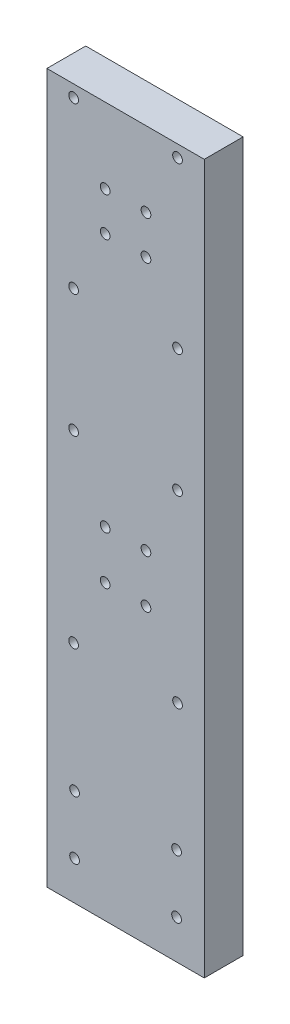
ISO-10303-21;
HEADER;
FILE_DESCRIPTION(('STEP AP214'),'2;1');
FILE_NAME('part.step','',(''),(''),'','','');
FILE_SCHEMA(('AUTOMOTIVE_DESIGN { 1 0 10303 214 1 1 1 1 }'));
ENDSEC;
DATA;
#1=APPLICATION_CONTEXT('core data for automotive mechanical design processes');
#2=APPLICATION_PROTOCOL_DEFINITION('international standard','automotive_design',2000,#1);
#3=PRODUCT_CONTEXT('',#1,'mechanical');
#4=PRODUCT('Part','Part','',(#3));
#5=PRODUCT_RELATED_PRODUCT_CATEGORY('part','',(#4));
#6=PRODUCT_DEFINITION_FORMATION('','',#4);
#7=PRODUCT_DEFINITION_CONTEXT('part definition',#1,'design');
#8=PRODUCT_DEFINITION('design','',#6,#7);
#9=PRODUCT_DEFINITION_SHAPE('','',#8);
#10=(LENGTH_UNIT() NAMED_UNIT(*) SI_UNIT(.MILLI.,.METRE.));
#11=(NAMED_UNIT(*) PLANE_ANGLE_UNIT() SI_UNIT($,.RADIAN.));
#12=(NAMED_UNIT(*) SI_UNIT($,.STERADIAN.) SOLID_ANGLE_UNIT());
#13=UNCERTAINTY_MEASURE_WITH_UNIT(LENGTH_MEASURE(1.E-05),#10,'distance_accuracy_value','');
#14=(GEOMETRIC_REPRESENTATION_CONTEXT(3) GLOBAL_UNCERTAINTY_ASSIGNED_CONTEXT((#13)) GLOBAL_UNIT_ASSIGNED_CONTEXT((#10,
#11,#12)) REPRESENTATION_CONTEXT('',''));
#15=CARTESIAN_POINT('',(0.,0.,0.));
#16=DIRECTION('',(0.,0.,1.));
#17=DIRECTION('',(1.,0.,0.));
#18=AXIS2_PLACEMENT_3D('',#15,#16,#17);
#19=CARTESIAN_POINT('',(0.,0.,4.));
#20=DIRECTION('',(0.,0.,-1.));
#21=DIRECTION('',(-1.,0.,0.));
#22=AXIS2_PLACEMENT_3D('',#19,#20,#21);
#23=PLANE('',#22);
#24=CARTESIAN_POINT('',(10.1999999999987,65.26,4.));
#25=DIRECTION('',(0.,0.,1.));
#26=DIRECTION('',(-1.,0.,0.));
#27=AXIS2_PLACEMENT_3D('',#24,#25,#26);
#28=CIRCLE('',#27,0.499999999999999);
#29=CARTESIAN_POINT('',(9.6999999999987,65.26,4.));
#30=VERTEX_POINT('',#29);
#31=EDGE_CURVE('E217',#30,#30,#28,.T.);
#32=ORIENTED_EDGE('',*,*,#31,.F.);
#33=EDGE_LOOP('',(#32));
#34=FACE_BOUND('',#33,.T.);
#35=CARTESIAN_POINT('',(2.7500000000006,54.76,4.));
#36=DIRECTION('',(0.,0.,1.));
#37=DIRECTION('',(1.,0.,0.));
#38=AXIS2_PLACEMENT_3D('',#35,#36,#37);
#39=CIRCLE('',#38,0.500000000000005);
#40=CARTESIAN_POINT('',(3.2500000000006,54.76,4.));
#41=VERTEX_POINT('',#40);
#42=EDGE_CURVE('E205',#41,#41,#39,.T.);
#43=ORIENTED_EDGE('',*,*,#42,.F.);
#44=EDGE_LOOP('',(#43));
#45=FACE_BOUND('',#44,.T.);
#46=CARTESIAN_POINT('',(13.350000000001,10.,4.));
#47=DIRECTION('',(0.,0.,1.));
#48=DIRECTION('',(-1.,0.,0.));
#49=AXIS2_PLACEMENT_3D('',#46,#47,#48);
#50=CIRCLE('',#49,0.499999999999999);
#51=CARTESIAN_POINT('',(12.850000000001,10.,4.));
#52=VERTEX_POINT('',#51);
#53=EDGE_CURVE('E193',#52,#52,#50,.T.);
#54=ORIENTED_EDGE('',*,*,#53,.F.);
#55=EDGE_LOOP('',(#54));
#56=FACE_BOUND('',#55,.T.);
#57=CARTESIAN_POINT('',(13.4500000000019,54.76,4.));
#58=DIRECTION('',(0.,0.,1.));
#59=DIRECTION('',(1.,0.,0.));
#60=AXIS2_PLACEMENT_3D('',#57,#58,#59);
#61=CIRCLE('',#60,0.499999999999999);
#62=CARTESIAN_POINT('',(13.9500000000019,54.76,4.));
#63=VERTEX_POINT('',#62);
#64=EDGE_CURVE('E181',#63,#63,#61,.T.);
#65=ORIENTED_EDGE('',*,*,#64,.F.);
#66=EDGE_LOOP('',(#65));
#67=FACE_BOUND('',#66,.T.);
#68=CARTESIAN_POINT('',(2.84999999999999,10.,4.));
#69=DIRECTION('',(0.,0.,1.));
#70=DIRECTION('',(1.,0.,0.));
#71=AXIS2_PLACEMENT_3D('',#68,#69,#70);
#72=CIRCLE('',#71,0.499999999999999);
#73=CARTESIAN_POINT('',(3.34999999999999,10.,4.));
#74=VERTEX_POINT('',#73);
#75=EDGE_CURVE('E169',#74,#74,#72,.T.);
#76=ORIENTED_EDGE('',*,*,#75,.F.);
#77=EDGE_LOOP('',(#76));
#78=FACE_BOUND('',#77,.T.);
#79=CARTESIAN_POINT('',(6.00000000000001,35.11,4.));
#80=DIRECTION('',(0.,0.,1.));
#81=DIRECTION('',(1.,0.,0.));
#82=AXIS2_PLACEMENT_3D('',#79,#80,#81);
#83=CIRCLE('',#82,0.500000000000002);
#84=CARTESIAN_POINT('',(6.50000000000001,35.11,4.));
#85=VERTEX_POINT('',#84);
#86=EDGE_CURVE('E157',#85,#85,#83,.T.);
#87=ORIENTED_EDGE('',*,*,#86,.F.);
#88=EDGE_LOOP('',(#87));
#89=FACE_BOUND('',#88,.T.);
#90=CARTESIAN_POINT('',(10.2000000000001,35.11,4.));
#91=DIRECTION('',(0.,0.,1.));
#92=DIRECTION('',(1.,0.,0.));
#93=AXIS2_PLACEMENT_3D('',#90,#91,#92);
#94=CIRCLE('',#93,0.499999999999999);
#95=CARTESIAN_POINT('',(10.7000000000001,35.11,4.));
#96=VERTEX_POINT('',#95);
#97=EDGE_CURVE('E145',#96,#96,#94,.T.);
#98=ORIENTED_EDGE('',*,*,#97,.F.);
#99=EDGE_LOOP('',(#98));
#100=FACE_BOUND('',#99,.T.);
#101=CARTESIAN_POINT('',(6.00000000000001,30.15,4.));
#102=DIRECTION('',(0.,0.,1.));
#103=DIRECTION('',(1.,0.,0.));
#104=AXIS2_PLACEMENT_3D('',#101,#102,#103);
#105=CIRCLE('',#104,0.5);
#106=CARTESIAN_POINT('',(6.50000000000001,30.15,4.));
#107=VERTEX_POINT('',#106);
#108=EDGE_CURVE('E133',#107,#107,#105,.T.);
#109=ORIENTED_EDGE('',*,*,#108,.F.);
#110=EDGE_LOOP('',(#109));
#111=FACE_BOUND('',#110,.T.);
#112=CARTESIAN_POINT('',(5.99999999999857,61.26,4.));
#113=DIRECTION('',(0.,0.,1.));
#114=DIRECTION('',(1.,0.,0.));
#115=AXIS2_PLACEMENT_3D('',#112,#113,#114);
#116=CIRCLE('',#115,0.500000000000003);
#117=CARTESIAN_POINT('',(6.49999999999857,61.26,4.));
#118=VERTEX_POINT('',#117);
#119=EDGE_CURVE('E121',#118,#118,#116,.T.);
#120=ORIENTED_EDGE('',*,*,#119,.F.);
#121=EDGE_LOOP('',(#120));
#122=FACE_BOUND('',#121,.T.);
#123=CARTESIAN_POINT('',(2.75000000000059,71.76,4.));
#124=DIRECTION('',(0.,0.,1.));
#125=DIRECTION('',(-1.,0.,0.));
#126=AXIS2_PLACEMENT_3D('',#123,#124,#125);
#127=CIRCLE('',#126,0.500000000000005);
#128=CARTESIAN_POINT('',(2.25000000000058,71.76,4.));
#129=VERTEX_POINT('',#128);
#130=EDGE_CURVE('E100',#129,#129,#127,.T.);
#131=ORIENTED_EDGE('',*,*,#130,.F.);
#132=EDGE_LOOP('',(#131));
#133=FACE_BOUND('',#132,.T.);
#134=DIRECTION('',(1.,0.,0.));
#135=VECTOR('',#134,1.);
#136=CARTESIAN_POINT('',(0.,0.,4.));
#137=LINE('',#136,#135);
#138=CARTESIAN_POINT('',(0.,0.,4.));
#139=VERTEX_POINT('',#138);
#140=CARTESIAN_POINT('',(16.2,0.,4.));
#141=VERTEX_POINT('',#140);
#142=EDGE_CURVE('E85',#139,#141,#137,.T.);
#143=ORIENTED_EDGE('',*,*,#142,.T.);
#144=DIRECTION('',(0.,1.,0.));
#145=VECTOR('',#144,1.);
#146=CARTESIAN_POINT('',(16.2,72.99,4.));
#147=LINE('',#146,#145);
#148=CARTESIAN_POINT('',(16.2,72.99,4.));
#149=VERTEX_POINT('',#148);
#150=EDGE_CURVE('E80',#141,#149,#147,.T.);
#151=ORIENTED_EDGE('',*,*,#150,.T.);
#152=DIRECTION('',(-1.,0.,0.));
#153=VECTOR('',#152,1.);
#154=CARTESIAN_POINT('',(0.,72.99,4.));
#155=LINE('',#154,#153);
#156=CARTESIAN_POINT('',(0.,72.99,4.));
#157=VERTEX_POINT('',#156);
#158=EDGE_CURVE('E83',#149,#157,#155,.T.);
#159=ORIENTED_EDGE('',*,*,#158,.T.);
#160=DIRECTION('',(0.,-1.,0.));
#161=VECTOR('',#160,1.);
#162=CARTESIAN_POINT('',(0.,0.,4.));
#163=LINE('',#162,#161);
#164=EDGE_CURVE('E50',#157,#139,#163,.T.);
#165=ORIENTED_EDGE('',*,*,#164,.T.);
#166=EDGE_LOOP('',(#143,#151,#159,#165));
#167=FACE_BOUND('',#166,.T.);
#168=CARTESIAN_POINT('',(10.1999999999987,61.26,4.));
#169=DIRECTION('',(0.,0.,1.));
#170=DIRECTION('',(1.,0.,0.));
#171=AXIS2_PLACEMENT_3D('',#168,#169,#170);
#172=CIRCLE('',#171,0.499999999999999);
#173=CARTESIAN_POINT('',(10.6999999999987,61.26,4.));
#174=VERTEX_POINT('',#173);
#175=EDGE_CURVE('E115',#174,#174,#172,.T.);
#176=ORIENTED_EDGE('',*,*,#175,.F.);
#177=EDGE_LOOP('',(#176));
#178=FACE_BOUND('',#177,.T.);
#179=CARTESIAN_POINT('',(10.2000000000001,30.15,4.));
#180=DIRECTION('',(0.,0.,1.));
#181=DIRECTION('',(1.,0.,0.));
#182=AXIS2_PLACEMENT_3D('',#179,#180,#181);
#183=CIRCLE('',#182,0.499999999999999);
#184=CARTESIAN_POINT('',(10.7000000000001,30.15,4.));
#185=VERTEX_POINT('',#184);
#186=EDGE_CURVE('E127',#185,#185,#183,.T.);
#187=ORIENTED_EDGE('',*,*,#186,.F.);
#188=EDGE_LOOP('',(#187));
#189=FACE_BOUND('',#188,.T.);
#190=CARTESIAN_POINT('',(13.4500000000001,23.15,4.));
#191=DIRECTION('',(0.,0.,1.));
#192=DIRECTION('',(1.,0.,0.));
#193=AXIS2_PLACEMENT_3D('',#190,#191,#192);
#194=CIRCLE('',#193,0.499999999999999);
#195=CARTESIAN_POINT('',(13.9500000000001,23.15,4.));
#196=VERTEX_POINT('',#195);
#197=EDGE_CURVE('E139',#196,#196,#194,.T.);
#198=ORIENTED_EDGE('',*,*,#197,.F.);
#199=EDGE_LOOP('',(#198));
#200=FACE_BOUND('',#199,.T.);
#201=CARTESIAN_POINT('',(2.75000000000003,23.15,4.));
#202=DIRECTION('',(0.,0.,1.));
#203=DIRECTION('',(1.,0.,0.));
#204=AXIS2_PLACEMENT_3D('',#201,#202,#203);
#205=CIRCLE('',#204,0.499999999999999);
#206=CARTESIAN_POINT('',(3.25000000000003,23.15,4.));
#207=VERTEX_POINT('',#206);
#208=EDGE_CURVE('E151',#207,#207,#205,.T.);
#209=ORIENTED_EDGE('',*,*,#208,.F.);
#210=EDGE_LOOP('',(#209));
#211=FACE_BOUND('',#210,.T.);
#212=CARTESIAN_POINT('',(13.45,42.11,4.));
#213=DIRECTION('',(0.,0.,1.));
#214=DIRECTION('',(1.,0.,0.));
#215=AXIS2_PLACEMENT_3D('',#212,#213,#214);
#216=CIRCLE('',#215,0.499999999999999);
#217=CARTESIAN_POINT('',(13.95,42.11,4.));
#218=VERTEX_POINT('',#217);
#219=EDGE_CURVE('E163',#218,#218,#216,.T.);
#220=ORIENTED_EDGE('',*,*,#219,.F.);
#221=EDGE_LOOP('',(#220));
#222=FACE_BOUND('',#221,.T.);
#223=CARTESIAN_POINT('',(2.75000000000003,42.11,4.));
#224=DIRECTION('',(0.,0.,1.));
#225=DIRECTION('',(1.,0.,0.));
#226=AXIS2_PLACEMENT_3D('',#223,#224,#225);
#227=CIRCLE('',#226,0.499999999999999);
#228=CARTESIAN_POINT('',(3.25000000000003,42.11,4.));
#229=VERTEX_POINT('',#228);
#230=EDGE_CURVE('E175',#229,#229,#227,.T.);
#231=ORIENTED_EDGE('',*,*,#230,.F.);
#232=EDGE_LOOP('',(#231));
#233=FACE_BOUND('',#232,.T.);
#234=CARTESIAN_POINT('',(2.84999999999999,4.,4.));
#235=DIRECTION('',(0.,0.,1.));
#236=DIRECTION('',(1.,0.,0.));
#237=AXIS2_PLACEMENT_3D('',#234,#235,#236);
#238=CIRCLE('',#237,0.499999999999999);
#239=CARTESIAN_POINT('',(3.34999999999999,4.,4.));
#240=VERTEX_POINT('',#239);
#241=EDGE_CURVE('E187',#240,#240,#238,.T.);
#242=ORIENTED_EDGE('',*,*,#241,.F.);
#243=EDGE_LOOP('',(#242));
#244=FACE_BOUND('',#243,.T.);
#245=CARTESIAN_POINT('',(13.350000000001,4.,4.));
#246=DIRECTION('',(0.,0.,1.));
#247=DIRECTION('',(-1.,0.,0.));
#248=AXIS2_PLACEMENT_3D('',#245,#246,#247);
#249=CIRCLE('',#248,0.499999999999999);
#250=CARTESIAN_POINT('',(12.850000000001,4.,4.));
#251=VERTEX_POINT('',#250);
#252=EDGE_CURVE('E199',#251,#251,#249,.T.);
#253=ORIENTED_EDGE('',*,*,#252,.F.);
#254=EDGE_LOOP('',(#253));
#255=FACE_BOUND('',#254,.T.);
#256=CARTESIAN_POINT('',(5.99999999999856,65.26,4.));
#257=DIRECTION('',(0.,0.,1.));
#258=DIRECTION('',(-1.,0.,0.));
#259=AXIS2_PLACEMENT_3D('',#256,#257,#258);
#260=CIRCLE('',#259,0.500000000000003);
#261=CARTESIAN_POINT('',(5.49999999999856,65.26,4.));
#262=VERTEX_POINT('',#261);
#263=EDGE_CURVE('E211',#262,#262,#260,.T.);
#264=ORIENTED_EDGE('',*,*,#263,.F.);
#265=EDGE_LOOP('',(#264));
#266=FACE_BOUND('',#265,.T.);
#267=CARTESIAN_POINT('',(13.4500000000019,71.76,4.));
#268=DIRECTION('',(0.,0.,1.));
#269=DIRECTION('',(-1.,0.,0.));
#270=AXIS2_PLACEMENT_3D('',#267,#268,#269);
#271=CIRCLE('',#270,0.500000000000006);
#272=CARTESIAN_POINT('',(12.9500000000019,71.76,4.));
#273=VERTEX_POINT('',#272);
#274=EDGE_CURVE('E223',#273,#273,#271,.T.);
#275=ORIENTED_EDGE('',*,*,#274,.F.);
#276=EDGE_LOOP('',(#275));
#277=FACE_BOUND('',#276,.T.);
#278=ADVANCED_FACE('F33',(#34,#45,#56,#67,#78,#89,#100,#111,#122,#133,#167,#178,#189,#200,#211,
#222,#233,#244,#255,#266,#277),#23,.F.);
#279=CARTESIAN_POINT('',(0.,0.,0.));
#280=DIRECTION('',(0.,0.,-1.));
#281=DIRECTION('',(-1.,0.,0.));
#282=AXIS2_PLACEMENT_3D('',#279,#280,#281);
#283=PLANE('',#282);
#284=CARTESIAN_POINT('',(10.1999999999987,65.26,0.));
#285=DIRECTION('',(0.,0.,1.));
#286=DIRECTION('',(-1.,0.,0.));
#287=AXIS2_PLACEMENT_3D('',#284,#285,#286);
#288=CIRCLE('',#287,0.499999999999999);
#289=CARTESIAN_POINT('',(9.6999999999987,65.26,0.));
#290=VERTEX_POINT('',#289);
#291=EDGE_CURVE('E220',#290,#290,#288,.T.);
#292=ORIENTED_EDGE('',*,*,#291,.T.);
#293=EDGE_LOOP('',(#292));
#294=FACE_BOUND('',#293,.T.);
#295=CARTESIAN_POINT('',(2.7500000000006,54.76,0.));
#296=DIRECTION('',(0.,0.,1.));
#297=DIRECTION('',(1.,0.,0.));
#298=AXIS2_PLACEMENT_3D('',#295,#296,#297);
#299=CIRCLE('',#298,0.500000000000005);
#300=CARTESIAN_POINT('',(3.2500000000006,54.76,0.));
#301=VERTEX_POINT('',#300);
#302=EDGE_CURVE('E208',#301,#301,#299,.T.);
#303=ORIENTED_EDGE('',*,*,#302,.T.);
#304=EDGE_LOOP('',(#303));
#305=FACE_BOUND('',#304,.T.);
#306=CARTESIAN_POINT('',(13.350000000001,10.,0.));
#307=DIRECTION('',(0.,0.,1.));
#308=DIRECTION('',(-1.,0.,0.));
#309=AXIS2_PLACEMENT_3D('',#306,#307,#308);
#310=CIRCLE('',#309,0.499999999999999);
#311=CARTESIAN_POINT('',(12.850000000001,10.,0.));
#312=VERTEX_POINT('',#311);
#313=EDGE_CURVE('E196',#312,#312,#310,.T.);
#314=ORIENTED_EDGE('',*,*,#313,.T.);
#315=EDGE_LOOP('',(#314));
#316=FACE_BOUND('',#315,.T.);
#317=CARTESIAN_POINT('',(13.4500000000019,54.76,0.));
#318=DIRECTION('',(0.,0.,1.));
#319=DIRECTION('',(1.,0.,0.));
#320=AXIS2_PLACEMENT_3D('',#317,#318,#319);
#321=CIRCLE('',#320,0.499999999999999);
#322=CARTESIAN_POINT('',(13.9500000000019,54.76,0.));
#323=VERTEX_POINT('',#322);
#324=EDGE_CURVE('E184',#323,#323,#321,.T.);
#325=ORIENTED_EDGE('',*,*,#324,.T.);
#326=EDGE_LOOP('',(#325));
#327=FACE_BOUND('',#326,.T.);
#328=CARTESIAN_POINT('',(2.84999999999999,10.,0.));
#329=DIRECTION('',(0.,0.,1.));
#330=DIRECTION('',(1.,0.,0.));
#331=AXIS2_PLACEMENT_3D('',#328,#329,#330);
#332=CIRCLE('',#331,0.499999999999999);
#333=CARTESIAN_POINT('',(3.34999999999999,10.,0.));
#334=VERTEX_POINT('',#333);
#335=EDGE_CURVE('E172',#334,#334,#332,.T.);
#336=ORIENTED_EDGE('',*,*,#335,.T.);
#337=EDGE_LOOP('',(#336));
#338=FACE_BOUND('',#337,.T.);
#339=CARTESIAN_POINT('',(6.00000000000001,35.11,0.));
#340=DIRECTION('',(0.,0.,1.));
#341=DIRECTION('',(1.,0.,0.));
#342=AXIS2_PLACEMENT_3D('',#339,#340,#341);
#343=CIRCLE('',#342,0.500000000000002);
#344=CARTESIAN_POINT('',(6.50000000000001,35.11,0.));
#345=VERTEX_POINT('',#344);
#346=EDGE_CURVE('E160',#345,#345,#343,.T.);
#347=ORIENTED_EDGE('',*,*,#346,.T.);
#348=EDGE_LOOP('',(#347));
#349=FACE_BOUND('',#348,.T.);
#350=CARTESIAN_POINT('',(10.2000000000001,35.11,0.));
#351=DIRECTION('',(0.,0.,1.));
#352=DIRECTION('',(1.,0.,0.));
#353=AXIS2_PLACEMENT_3D('',#350,#351,#352);
#354=CIRCLE('',#353,0.499999999999999);
#355=CARTESIAN_POINT('',(10.7000000000001,35.11,0.));
#356=VERTEX_POINT('',#355);
#357=EDGE_CURVE('E148',#356,#356,#354,.T.);
#358=ORIENTED_EDGE('',*,*,#357,.T.);
#359=EDGE_LOOP('',(#358));
#360=FACE_BOUND('',#359,.T.);
#361=CARTESIAN_POINT('',(6.00000000000001,30.15,0.));
#362=DIRECTION('',(0.,0.,1.));
#363=DIRECTION('',(1.,0.,0.));
#364=AXIS2_PLACEMENT_3D('',#361,#362,#363);
#365=CIRCLE('',#364,0.5);
#366=CARTESIAN_POINT('',(6.50000000000001,30.15,0.));
#367=VERTEX_POINT('',#366);
#368=EDGE_CURVE('E136',#367,#367,#365,.T.);
#369=ORIENTED_EDGE('',*,*,#368,.T.);
#370=EDGE_LOOP('',(#369));
#371=FACE_BOUND('',#370,.T.);
#372=CARTESIAN_POINT('',(5.99999999999857,61.26,0.));
#373=DIRECTION('',(0.,0.,1.));
#374=DIRECTION('',(1.,0.,0.));
#375=AXIS2_PLACEMENT_3D('',#372,#373,#374);
#376=CIRCLE('',#375,0.500000000000003);
#377=CARTESIAN_POINT('',(6.49999999999857,61.26,0.));
#378=VERTEX_POINT('',#377);
#379=EDGE_CURVE('E124',#378,#378,#376,.T.);
#380=ORIENTED_EDGE('',*,*,#379,.T.);
#381=EDGE_LOOP('',(#380));
#382=FACE_BOUND('',#381,.T.);
#383=CARTESIAN_POINT('',(2.75000000000059,71.76,0.));
#384=DIRECTION('',(0.,0.,1.));
#385=DIRECTION('',(-1.,0.,0.));
#386=AXIS2_PLACEMENT_3D('',#383,#384,#385);
#387=CIRCLE('',#386,0.500000000000005);
#388=CARTESIAN_POINT('',(2.25000000000058,71.76,0.));
#389=VERTEX_POINT('',#388);
#390=EDGE_CURVE('E112',#389,#389,#387,.T.);
#391=ORIENTED_EDGE('',*,*,#390,.T.);
#392=EDGE_LOOP('',(#391));
#393=FACE_BOUND('',#392,.T.);
#394=DIRECTION('',(1.,0.,0.));
#395=VECTOR('',#394,1.);
#396=CARTESIAN_POINT('',(0.,0.,0.));
#397=LINE('',#396,#395);
#398=CARTESIAN_POINT('',(0.,0.,0.));
#399=VERTEX_POINT('',#398);
#400=CARTESIAN_POINT('',(16.2,0.,0.));
#401=VERTEX_POINT('',#400);
#402=EDGE_CURVE('E97',#399,#401,#397,.T.);
#403=ORIENTED_EDGE('',*,*,#402,.F.);
#404=DIRECTION('',(0.,-1.,0.));
#405=VECTOR('',#404,1.);
#406=CARTESIAN_POINT('',(0.,0.,0.));
#407=LINE('',#406,#405);
#408=CARTESIAN_POINT('',(0.,72.99,0.));
#409=VERTEX_POINT('',#408);
#410=EDGE_CURVE('E73',#409,#399,#407,.T.);
#411=ORIENTED_EDGE('',*,*,#410,.F.);
#412=DIRECTION('',(-1.,0.,0.));
#413=VECTOR('',#412,1.);
#414=CARTESIAN_POINT('',(0.,72.99,0.));
#415=LINE('',#414,#413);
#416=CARTESIAN_POINT('',(16.2,72.99,0.));
#417=VERTEX_POINT('',#416);
#418=EDGE_CURVE('E67',#417,#409,#415,.T.);
#419=ORIENTED_EDGE('',*,*,#418,.F.);
#420=DIRECTION('',(0.,1.,0.));
#421=VECTOR('',#420,1.);
#422=CARTESIAN_POINT('',(16.2,72.99,0.));
#423=LINE('',#422,#421);
#424=EDGE_CURVE('E89',#401,#417,#423,.T.);
#425=ORIENTED_EDGE('',*,*,#424,.F.);
#426=EDGE_LOOP('',(#403,#411,#419,#425));
#427=FACE_BOUND('',#426,.T.);
#428=CARTESIAN_POINT('',(10.1999999999987,61.26,0.));
#429=DIRECTION('',(0.,0.,1.));
#430=DIRECTION('',(1.,0.,0.));
#431=AXIS2_PLACEMENT_3D('',#428,#429,#430);
#432=CIRCLE('',#431,0.499999999999999);
#433=CARTESIAN_POINT('',(10.6999999999987,61.26,0.));
#434=VERTEX_POINT('',#433);
#435=EDGE_CURVE('E118',#434,#434,#432,.T.);
#436=ORIENTED_EDGE('',*,*,#435,.T.);
#437=EDGE_LOOP('',(#436));
#438=FACE_BOUND('',#437,.T.);
#439=CARTESIAN_POINT('',(10.2000000000001,30.15,0.));
#440=DIRECTION('',(0.,0.,1.));
#441=DIRECTION('',(1.,0.,0.));
#442=AXIS2_PLACEMENT_3D('',#439,#440,#441);
#443=CIRCLE('',#442,0.499999999999999);
#444=CARTESIAN_POINT('',(10.7000000000001,30.15,0.));
#445=VERTEX_POINT('',#444);
#446=EDGE_CURVE('E130',#445,#445,#443,.T.);
#447=ORIENTED_EDGE('',*,*,#446,.T.);
#448=EDGE_LOOP('',(#447));
#449=FACE_BOUND('',#448,.T.);
#450=CARTESIAN_POINT('',(13.4500000000001,23.15,0.));
#451=DIRECTION('',(0.,0.,1.));
#452=DIRECTION('',(1.,0.,0.));
#453=AXIS2_PLACEMENT_3D('',#450,#451,#452);
#454=CIRCLE('',#453,0.499999999999999);
#455=CARTESIAN_POINT('',(13.9500000000001,23.15,0.));
#456=VERTEX_POINT('',#455);
#457=EDGE_CURVE('E142',#456,#456,#454,.T.);
#458=ORIENTED_EDGE('',*,*,#457,.T.);
#459=EDGE_LOOP('',(#458));
#460=FACE_BOUND('',#459,.T.);
#461=CARTESIAN_POINT('',(2.75000000000003,23.15,0.));
#462=DIRECTION('',(0.,0.,1.));
#463=DIRECTION('',(1.,0.,0.));
#464=AXIS2_PLACEMENT_3D('',#461,#462,#463);
#465=CIRCLE('',#464,0.499999999999999);
#466=CARTESIAN_POINT('',(3.25000000000003,23.15,0.));
#467=VERTEX_POINT('',#466);
#468=EDGE_CURVE('E154',#467,#467,#465,.T.);
#469=ORIENTED_EDGE('',*,*,#468,.T.);
#470=EDGE_LOOP('',(#469));
#471=FACE_BOUND('',#470,.T.);
#472=CARTESIAN_POINT('',(13.45,42.11,0.));
#473=DIRECTION('',(0.,0.,1.));
#474=DIRECTION('',(1.,0.,0.));
#475=AXIS2_PLACEMENT_3D('',#472,#473,#474);
#476=CIRCLE('',#475,0.499999999999999);
#477=CARTESIAN_POINT('',(13.95,42.11,0.));
#478=VERTEX_POINT('',#477);
#479=EDGE_CURVE('E166',#478,#478,#476,.T.);
#480=ORIENTED_EDGE('',*,*,#479,.T.);
#481=EDGE_LOOP('',(#480));
#482=FACE_BOUND('',#481,.T.);
#483=CARTESIAN_POINT('',(2.75000000000003,42.11,0.));
#484=DIRECTION('',(0.,0.,1.));
#485=DIRECTION('',(1.,0.,0.));
#486=AXIS2_PLACEMENT_3D('',#483,#484,#485);
#487=CIRCLE('',#486,0.499999999999999);
#488=CARTESIAN_POINT('',(3.25000000000003,42.11,0.));
#489=VERTEX_POINT('',#488);
#490=EDGE_CURVE('E178',#489,#489,#487,.T.);
#491=ORIENTED_EDGE('',*,*,#490,.T.);
#492=EDGE_LOOP('',(#491));
#493=FACE_BOUND('',#492,.T.);
#494=CARTESIAN_POINT('',(2.84999999999999,4.,0.));
#495=DIRECTION('',(0.,0.,1.));
#496=DIRECTION('',(1.,0.,0.));
#497=AXIS2_PLACEMENT_3D('',#494,#495,#496);
#498=CIRCLE('',#497,0.499999999999999);
#499=CARTESIAN_POINT('',(3.34999999999999,4.,0.));
#500=VERTEX_POINT('',#499);
#501=EDGE_CURVE('E190',#500,#500,#498,.T.);
#502=ORIENTED_EDGE('',*,*,#501,.T.);
#503=EDGE_LOOP('',(#502));
#504=FACE_BOUND('',#503,.T.);
#505=CARTESIAN_POINT('',(13.350000000001,4.,0.));
#506=DIRECTION('',(0.,0.,1.));
#507=DIRECTION('',(-1.,0.,0.));
#508=AXIS2_PLACEMENT_3D('',#505,#506,#507);
#509=CIRCLE('',#508,0.499999999999999);
#510=CARTESIAN_POINT('',(12.850000000001,4.,0.));
#511=VERTEX_POINT('',#510);
#512=EDGE_CURVE('E202',#511,#511,#509,.T.);
#513=ORIENTED_EDGE('',*,*,#512,.T.);
#514=EDGE_LOOP('',(#513));
#515=FACE_BOUND('',#514,.T.);
#516=CARTESIAN_POINT('',(5.99999999999856,65.26,0.));
#517=DIRECTION('',(0.,0.,1.));
#518=DIRECTION('',(-1.,0.,0.));
#519=AXIS2_PLACEMENT_3D('',#516,#517,#518);
#520=CIRCLE('',#519,0.500000000000003);
#521=CARTESIAN_POINT('',(5.49999999999856,65.26,0.));
#522=VERTEX_POINT('',#521);
#523=EDGE_CURVE('E214',#522,#522,#520,.T.);
#524=ORIENTED_EDGE('',*,*,#523,.T.);
#525=EDGE_LOOP('',(#524));
#526=FACE_BOUND('',#525,.T.);
#527=CARTESIAN_POINT('',(13.4500000000019,71.76,0.));
#528=DIRECTION('',(0.,0.,1.));
#529=DIRECTION('',(-1.,0.,0.));
#530=AXIS2_PLACEMENT_3D('',#527,#528,#529);
#531=CIRCLE('',#530,0.500000000000006);
#532=CARTESIAN_POINT('',(12.9500000000019,71.76,0.));
#533=VERTEX_POINT('',#532);
#534=EDGE_CURVE('E226',#533,#533,#531,.T.);
#535=ORIENTED_EDGE('',*,*,#534,.T.);
#536=EDGE_LOOP('',(#535));
#537=FACE_BOUND('',#536,.T.);
#538=ADVANCED_FACE('F108',(#294,#305,#316,#327,#338,#349,#360,#371,#382,#393,#427,#438,#449,
#460,#471,#482,#493,#504,#515,#526,#537),#283,.T.);
#539=CARTESIAN_POINT('',(0.,0.,4.));
#540=DIRECTION('',(0.,1.,0.));
#541=DIRECTION('',(0.,0.,1.));
#542=AXIS2_PLACEMENT_3D('',#539,#540,#541);
#543=PLANE('',#542);
#544=ORIENTED_EDGE('',*,*,#402,.T.);
#545=DIRECTION('',(0.,0.,-1.));
#546=VECTOR('',#545,1.);
#547=CARTESIAN_POINT('',(16.2,0.,4.));
#548=LINE('',#547,#546);
#549=EDGE_CURVE('E11',#141,#401,#548,.T.);
#550=ORIENTED_EDGE('',*,*,#549,.F.);
#551=ORIENTED_EDGE('',*,*,#142,.F.);
#552=DIRECTION('',(0.,0.,-1.));
#553=VECTOR('',#552,1.);
#554=CARTESIAN_POINT('',(0.,0.,4.));
#555=LINE('',#554,#553);
#556=EDGE_CURVE('E93',#139,#399,#555,.T.);
#557=ORIENTED_EDGE('',*,*,#556,.T.);
#558=EDGE_LOOP('',(#544,#550,#551,#557));
#559=FACE_BOUND('',#558,.T.);
#560=ADVANCED_FACE('F35',(#559),#543,.F.);
#561=CARTESIAN_POINT('',(16.2,72.99,4.));
#562=DIRECTION('',(-1.,0.,0.));
#563=DIRECTION('',(0.,-1.,0.));
#564=AXIS2_PLACEMENT_3D('',#561,#562,#563);
#565=PLANE('',#564);
#566=ORIENTED_EDGE('',*,*,#424,.T.);
#567=DIRECTION('',(0.,0.,-1.));
#568=VECTOR('',#567,1.);
#569=CARTESIAN_POINT('',(16.2,72.99,4.));
#570=LINE('',#569,#568);
#571=EDGE_CURVE('E42',#149,#417,#570,.T.);
#572=ORIENTED_EDGE('',*,*,#571,.F.);
#573=ORIENTED_EDGE('',*,*,#150,.F.);
#574=ORIENTED_EDGE('',*,*,#549,.T.);
#575=EDGE_LOOP('',(#566,#572,#573,#574));
#576=FACE_BOUND('',#575,.T.);
#577=ADVANCED_FACE('F88',(#576),#565,.F.);
#578=CARTESIAN_POINT('',(0.,72.99,4.));
#579=DIRECTION('',(0.,-1.,0.));
#580=DIRECTION('',(0.,0.,-1.));
#581=AXIS2_PLACEMENT_3D('',#578,#579,#580);
#582=PLANE('',#581);
#583=ORIENTED_EDGE('',*,*,#418,.T.);
#584=DIRECTION('',(0.,0.,-1.));
#585=VECTOR('',#584,1.);
#586=CARTESIAN_POINT('',(0.,72.99,4.));
#587=LINE('',#586,#585);
#588=EDGE_CURVE('E90',#157,#409,#587,.T.);
#589=ORIENTED_EDGE('',*,*,#588,.F.);
#590=ORIENTED_EDGE('',*,*,#158,.F.);
#591=ORIENTED_EDGE('',*,*,#571,.T.);
#592=EDGE_LOOP('',(#583,#589,#590,#591));
#593=FACE_BOUND('',#592,.T.);
#594=ADVANCED_FACE('F91',(#593),#582,.F.);
#595=CARTESIAN_POINT('',(0.,0.,4.));
#596=DIRECTION('',(1.,0.,0.));
#597=DIRECTION('',(0.,0.,-1.));
#598=AXIS2_PLACEMENT_3D('',#595,#596,#597);
#599=PLANE('',#598);
#600=ORIENTED_EDGE('',*,*,#410,.T.);
#601=ORIENTED_EDGE('',*,*,#556,.F.);
#602=ORIENTED_EDGE('',*,*,#164,.F.);
#603=ORIENTED_EDGE('',*,*,#588,.T.);
#604=EDGE_LOOP('',(#600,#601,#602,#603));
#605=FACE_BOUND('',#604,.T.);
#606=ADVANCED_FACE('F105',(#605),#599,.F.);
#607=CARTESIAN_POINT('',(2.75000000000059,71.76,4.));
#608=DIRECTION('',(0.,0.,-1.));
#609=DIRECTION('',(-1.,0.,0.));
#610=AXIS2_PLACEMENT_3D('',#607,#608,#609);
#611=CYLINDRICAL_SURFACE('',#610,0.500000000000005);
#612=ORIENTED_EDGE('',*,*,#130,.T.);
#613=EDGE_LOOP('',(#612));
#614=FACE_BOUND('',#613,.T.);
#615=ORIENTED_EDGE('',*,*,#390,.F.);
#616=EDGE_LOOP('',(#615));
#617=FACE_BOUND('',#616,.T.);
#618=ADVANCED_FACE('F246',(#614,#617),#611,.F.);
#619=CARTESIAN_POINT('',(10.1999999999987,61.26,4.));
#620=DIRECTION('',(0.,0.,-1.));
#621=DIRECTION('',(-1.,0.,0.));
#622=AXIS2_PLACEMENT_3D('',#619,#620,#621);
#623=CYLINDRICAL_SURFACE('',#622,0.499999999999999);
#624=ORIENTED_EDGE('',*,*,#175,.T.);
#625=EDGE_LOOP('',(#624));
#626=FACE_BOUND('',#625,.T.);
#627=ORIENTED_EDGE('',*,*,#435,.F.);
#628=EDGE_LOOP('',(#627));
#629=FACE_BOUND('',#628,.T.);
#630=ADVANCED_FACE('F292',(#626,#629),#623,.F.);
#631=CARTESIAN_POINT('',(5.99999999999857,61.26,4.));
#632=DIRECTION('',(0.,0.,-1.));
#633=DIRECTION('',(-1.,0.,0.));
#634=AXIS2_PLACEMENT_3D('',#631,#632,#633);
#635=CYLINDRICAL_SURFACE('',#634,0.500000000000003);
#636=ORIENTED_EDGE('',*,*,#119,.T.);
#637=EDGE_LOOP('',(#636));
#638=FACE_BOUND('',#637,.T.);
#639=ORIENTED_EDGE('',*,*,#379,.F.);
#640=EDGE_LOOP('',(#639));
#641=FACE_BOUND('',#640,.T.);
#642=ADVANCED_FACE('F300',(#638,#641),#635,.F.);
#643=CARTESIAN_POINT('',(10.2000000000001,30.15,4.));
#644=DIRECTION('',(0.,0.,-1.));
#645=DIRECTION('',(-1.,0.,0.));
#646=AXIS2_PLACEMENT_3D('',#643,#644,#645);
#647=CYLINDRICAL_SURFACE('',#646,0.499999999999999);
#648=ORIENTED_EDGE('',*,*,#186,.T.);
#649=EDGE_LOOP('',(#648));
#650=FACE_BOUND('',#649,.T.);
#651=ORIENTED_EDGE('',*,*,#446,.F.);
#652=EDGE_LOOP('',(#651));
#653=FACE_BOUND('',#652,.T.);
#654=ADVANCED_FACE('F308',(#650,#653),#647,.F.);
#655=CARTESIAN_POINT('',(6.00000000000001,30.15,4.));
#656=DIRECTION('',(0.,0.,-1.));
#657=DIRECTION('',(-1.,0.,0.));
#658=AXIS2_PLACEMENT_3D('',#655,#656,#657);
#659=CYLINDRICAL_SURFACE('',#658,0.5);
#660=ORIENTED_EDGE('',*,*,#108,.T.);
#661=EDGE_LOOP('',(#660));
#662=FACE_BOUND('',#661,.T.);
#663=ORIENTED_EDGE('',*,*,#368,.F.);
#664=EDGE_LOOP('',(#663));
#665=FACE_BOUND('',#664,.T.);
#666=ADVANCED_FACE('F317',(#662,#665),#659,.F.);
#667=CARTESIAN_POINT('',(13.4500000000001,23.15,4.));
#668=DIRECTION('',(0.,0.,-1.));
#669=DIRECTION('',(-1.,0.,0.));
#670=AXIS2_PLACEMENT_3D('',#667,#668,#669);
#671=CYLINDRICAL_SURFACE('',#670,0.499999999999999);
#672=ORIENTED_EDGE('',*,*,#197,.T.);
#673=EDGE_LOOP('',(#672));
#674=FACE_BOUND('',#673,.T.);
#675=ORIENTED_EDGE('',*,*,#457,.F.);
#676=EDGE_LOOP('',(#675));
#677=FACE_BOUND('',#676,.T.);
#678=ADVANCED_FACE('F326',(#674,#677),#671,.F.);
#679=CARTESIAN_POINT('',(10.2000000000001,35.11,4.));
#680=DIRECTION('',(0.,0.,-1.));
#681=DIRECTION('',(-1.,0.,0.));
#682=AXIS2_PLACEMENT_3D('',#679,#680,#681);
#683=CYLINDRICAL_SURFACE('',#682,0.499999999999999);
#684=ORIENTED_EDGE('',*,*,#97,.T.);
#685=EDGE_LOOP('',(#684));
#686=FACE_BOUND('',#685,.T.);
#687=ORIENTED_EDGE('',*,*,#357,.F.);
#688=EDGE_LOOP('',(#687));
#689=FACE_BOUND('',#688,.T.);
#690=ADVANCED_FACE('F335',(#686,#689),#683,.F.);
#691=CARTESIAN_POINT('',(2.75000000000003,23.15,4.));
#692=DIRECTION('',(0.,0.,-1.));
#693=DIRECTION('',(-1.,0.,0.));
#694=AXIS2_PLACEMENT_3D('',#691,#692,#693);
#695=CYLINDRICAL_SURFACE('',#694,0.499999999999999);
#696=ORIENTED_EDGE('',*,*,#208,.T.);
#697=EDGE_LOOP('',(#696));
#698=FACE_BOUND('',#697,.T.);
#699=ORIENTED_EDGE('',*,*,#468,.F.);
#700=EDGE_LOOP('',(#699));
#701=FACE_BOUND('',#700,.T.);
#702=ADVANCED_FACE('F344',(#698,#701),#695,.F.);
#703=CARTESIAN_POINT('',(6.00000000000001,35.11,4.));
#704=DIRECTION('',(0.,0.,-1.));
#705=DIRECTION('',(-1.,0.,0.));
#706=AXIS2_PLACEMENT_3D('',#703,#704,#705);
#707=CYLINDRICAL_SURFACE('',#706,0.500000000000002);
#708=ORIENTED_EDGE('',*,*,#86,.T.);
#709=EDGE_LOOP('',(#708));
#710=FACE_BOUND('',#709,.T.);
#711=ORIENTED_EDGE('',*,*,#346,.F.);
#712=EDGE_LOOP('',(#711));
#713=FACE_BOUND('',#712,.T.);
#714=ADVANCED_FACE('F353',(#710,#713),#707,.F.);
#715=CARTESIAN_POINT('',(13.45,42.11,4.));
#716=DIRECTION('',(0.,0.,-1.));
#717=DIRECTION('',(-1.,0.,0.));
#718=AXIS2_PLACEMENT_3D('',#715,#716,#717);
#719=CYLINDRICAL_SURFACE('',#718,0.499999999999999);
#720=ORIENTED_EDGE('',*,*,#219,.T.);
#721=EDGE_LOOP('',(#720));
#722=FACE_BOUND('',#721,.T.);
#723=ORIENTED_EDGE('',*,*,#479,.F.);
#724=EDGE_LOOP('',(#723));
#725=FACE_BOUND('',#724,.T.);
#726=ADVANCED_FACE('F362',(#722,#725),#719,.F.);
#727=CARTESIAN_POINT('',(2.84999999999999,10.,4.));
#728=DIRECTION('',(0.,0.,-1.));
#729=DIRECTION('',(-1.,0.,0.));
#730=AXIS2_PLACEMENT_3D('',#727,#728,#729);
#731=CYLINDRICAL_SURFACE('',#730,0.499999999999999);
#732=ORIENTED_EDGE('',*,*,#75,.T.);
#733=EDGE_LOOP('',(#732));
#734=FACE_BOUND('',#733,.T.);
#735=ORIENTED_EDGE('',*,*,#335,.F.);
#736=EDGE_LOOP('',(#735));
#737=FACE_BOUND('',#736,.T.);
#738=ADVANCED_FACE('F371',(#734,#737),#731,.F.);
#739=CARTESIAN_POINT('',(2.75000000000003,42.11,4.));
#740=DIRECTION('',(0.,0.,-1.));
#741=DIRECTION('',(-1.,0.,0.));
#742=AXIS2_PLACEMENT_3D('',#739,#740,#741);
#743=CYLINDRICAL_SURFACE('',#742,0.499999999999999);
#744=ORIENTED_EDGE('',*,*,#230,.T.);
#745=EDGE_LOOP('',(#744));
#746=FACE_BOUND('',#745,.T.);
#747=ORIENTED_EDGE('',*,*,#490,.F.);
#748=EDGE_LOOP('',(#747));
#749=FACE_BOUND('',#748,.T.);
#750=ADVANCED_FACE('F380',(#746,#749),#743,.F.);
#751=CARTESIAN_POINT('',(13.4500000000019,54.76,4.));
#752=DIRECTION('',(0.,0.,-1.));
#753=DIRECTION('',(-1.,0.,0.));
#754=AXIS2_PLACEMENT_3D('',#751,#752,#753);
#755=CYLINDRICAL_SURFACE('',#754,0.499999999999999);
#756=ORIENTED_EDGE('',*,*,#64,.T.);
#757=EDGE_LOOP('',(#756));
#758=FACE_BOUND('',#757,.T.);
#759=ORIENTED_EDGE('',*,*,#324,.F.);
#760=EDGE_LOOP('',(#759));
#761=FACE_BOUND('',#760,.T.);
#762=ADVANCED_FACE('F389',(#758,#761),#755,.F.);
#763=CARTESIAN_POINT('',(2.84999999999999,4.,4.));
#764=DIRECTION('',(0.,0.,-1.));
#765=DIRECTION('',(-1.,0.,0.));
#766=AXIS2_PLACEMENT_3D('',#763,#764,#765);
#767=CYLINDRICAL_SURFACE('',#766,0.499999999999999);
#768=ORIENTED_EDGE('',*,*,#241,.T.);
#769=EDGE_LOOP('',(#768));
#770=FACE_BOUND('',#769,.T.);
#771=ORIENTED_EDGE('',*,*,#501,.F.);
#772=EDGE_LOOP('',(#771));
#773=FACE_BOUND('',#772,.T.);
#774=ADVANCED_FACE('F398',(#770,#773),#767,.F.);
#775=CARTESIAN_POINT('',(13.350000000001,10.,4.));
#776=DIRECTION('',(0.,0.,-1.));
#777=DIRECTION('',(-1.,0.,0.));
#778=AXIS2_PLACEMENT_3D('',#775,#776,#777);
#779=CYLINDRICAL_SURFACE('',#778,0.499999999999999);
#780=ORIENTED_EDGE('',*,*,#53,.T.);
#781=EDGE_LOOP('',(#780));
#782=FACE_BOUND('',#781,.T.);
#783=ORIENTED_EDGE('',*,*,#313,.F.);
#784=EDGE_LOOP('',(#783));
#785=FACE_BOUND('',#784,.T.);
#786=ADVANCED_FACE('F407',(#782,#785),#779,.F.);
#787=CARTESIAN_POINT('',(13.350000000001,4.,4.));
#788=DIRECTION('',(0.,0.,-1.));
#789=DIRECTION('',(-1.,0.,0.));
#790=AXIS2_PLACEMENT_3D('',#787,#788,#789);
#791=CYLINDRICAL_SURFACE('',#790,0.499999999999999);
#792=ORIENTED_EDGE('',*,*,#252,.T.);
#793=EDGE_LOOP('',(#792));
#794=FACE_BOUND('',#793,.T.);
#795=ORIENTED_EDGE('',*,*,#512,.F.);
#796=EDGE_LOOP('',(#795));
#797=FACE_BOUND('',#796,.T.);
#798=ADVANCED_FACE('F416',(#794,#797),#791,.F.);
#799=CARTESIAN_POINT('',(2.7500000000006,54.76,4.));
#800=DIRECTION('',(0.,0.,-1.));
#801=DIRECTION('',(-1.,0.,0.));
#802=AXIS2_PLACEMENT_3D('',#799,#800,#801);
#803=CYLINDRICAL_SURFACE('',#802,0.500000000000005);
#804=ORIENTED_EDGE('',*,*,#42,.T.);
#805=EDGE_LOOP('',(#804));
#806=FACE_BOUND('',#805,.T.);
#807=ORIENTED_EDGE('',*,*,#302,.F.);
#808=EDGE_LOOP('',(#807));
#809=FACE_BOUND('',#808,.T.);
#810=ADVANCED_FACE('F425',(#806,#809),#803,.F.);
#811=CARTESIAN_POINT('',(5.99999999999856,65.26,4.));
#812=DIRECTION('',(0.,0.,-1.));
#813=DIRECTION('',(-1.,0.,0.));
#814=AXIS2_PLACEMENT_3D('',#811,#812,#813);
#815=CYLINDRICAL_SURFACE('',#814,0.500000000000003);
#816=ORIENTED_EDGE('',*,*,#263,.T.);
#817=EDGE_LOOP('',(#816));
#818=FACE_BOUND('',#817,.T.);
#819=ORIENTED_EDGE('',*,*,#523,.F.);
#820=EDGE_LOOP('',(#819));
#821=FACE_BOUND('',#820,.T.);
#822=ADVANCED_FACE('F434',(#818,#821),#815,.F.);
#823=CARTESIAN_POINT('',(10.1999999999987,65.26,4.));
#824=DIRECTION('',(0.,0.,-1.));
#825=DIRECTION('',(-1.,0.,0.));
#826=AXIS2_PLACEMENT_3D('',#823,#824,#825);
#827=CYLINDRICAL_SURFACE('',#826,0.499999999999999);
#828=ORIENTED_EDGE('',*,*,#31,.T.);
#829=EDGE_LOOP('',(#828));
#830=FACE_BOUND('',#829,.T.);
#831=ORIENTED_EDGE('',*,*,#291,.F.);
#832=EDGE_LOOP('',(#831));
#833=FACE_BOUND('',#832,.T.);
#834=ADVANCED_FACE('F443',(#830,#833),#827,.F.);
#835=CARTESIAN_POINT('',(13.4500000000019,71.76,4.));
#836=DIRECTION('',(0.,0.,-1.));
#837=DIRECTION('',(-1.,0.,0.));
#838=AXIS2_PLACEMENT_3D('',#835,#836,#837);
#839=CYLINDRICAL_SURFACE('',#838,0.500000000000006);
#840=ORIENTED_EDGE('',*,*,#274,.T.);
#841=EDGE_LOOP('',(#840));
#842=FACE_BOUND('',#841,.T.);
#843=ORIENTED_EDGE('',*,*,#534,.F.);
#844=EDGE_LOOP('',(#843));
#845=FACE_BOUND('',#844,.T.);
#846=ADVANCED_FACE('F232',(#842,#845),#839,.F.);
#847=CLOSED_SHELL('',(#278,#538,#560,#577,#594,#606,#618,#630,#642,#654,#666,#678,#690,#702,
#714,#726,#738,#750,#762,#774,#786,#798,#810,#822,#834,#846));
#848=MANIFOLD_SOLID_BREP('B2',#847);
#849=ADVANCED_BREP_SHAPE_REPRESENTATION('',(#18,#848),#14);
#850=SHAPE_DEFINITION_REPRESENTATION(#9,#849);
ENDSEC;
END-ISO-10303-21;
